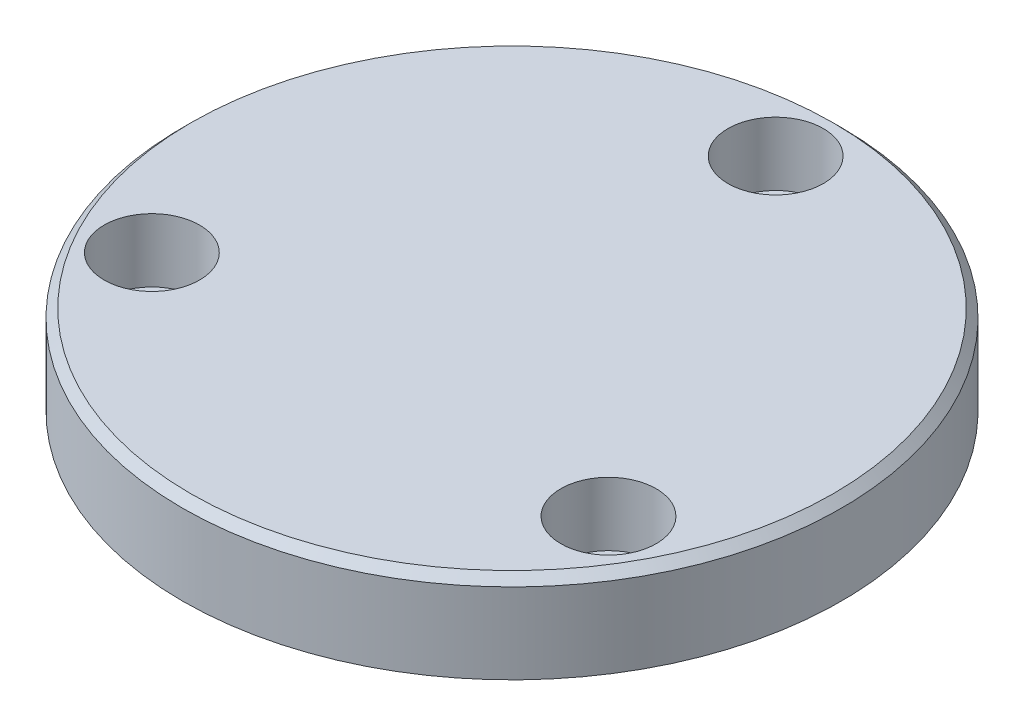
ISO-10303-21;
HEADER;
FILE_DESCRIPTION(('STEP AP214'),'2;1');
FILE_NAME('part.step','',(''),(''),'','','');
FILE_SCHEMA(('AUTOMOTIVE_DESIGN { 1 0 10303 214 1 1 1 1 }'));
ENDSEC;
DATA;
#1=APPLICATION_CONTEXT('core data for automotive mechanical design processes');
#2=APPLICATION_PROTOCOL_DEFINITION('international standard','automotive_design',2000,#1);
#3=PRODUCT_CONTEXT('',#1,'mechanical');
#4=PRODUCT('Part','Part','',(#3));
#5=PRODUCT_RELATED_PRODUCT_CATEGORY('part','',(#4));
#6=PRODUCT_DEFINITION_FORMATION('','',#4);
#7=PRODUCT_DEFINITION_CONTEXT('part definition',#1,'design');
#8=PRODUCT_DEFINITION('design','',#6,#7);
#9=PRODUCT_DEFINITION_SHAPE('','',#8);
#10=(LENGTH_UNIT() NAMED_UNIT(*) SI_UNIT(.MILLI.,.METRE.));
#11=(NAMED_UNIT(*) PLANE_ANGLE_UNIT() SI_UNIT($,.RADIAN.));
#12=(NAMED_UNIT(*) SI_UNIT($,.STERADIAN.) SOLID_ANGLE_UNIT());
#13=UNCERTAINTY_MEASURE_WITH_UNIT(LENGTH_MEASURE(1.E-05),#10,'distance_accuracy_value','');
#14=(GEOMETRIC_REPRESENTATION_CONTEXT(3) GLOBAL_UNCERTAINTY_ASSIGNED_CONTEXT((#13)) GLOBAL_UNIT_ASSIGNED_CONTEXT((#10,
#11,#12)) REPRESENTATION_CONTEXT('',''));
#15=CARTESIAN_POINT('',(0.,0.,0.));
#16=DIRECTION('',(0.,0.,1.));
#17=DIRECTION('',(1.,0.,0.));
#18=AXIS2_PLACEMENT_3D('',#15,#16,#17);
#19=CARTESIAN_POINT('',(0.,4.318,0.));
#20=DIRECTION('',(0.,-1.,0.));
#21=DIRECTION('',(0.,0.,-1.));
#22=AXIS2_PLACEMENT_3D('',#19,#20,#21);
#23=CYLINDRICAL_SURFACE('',#22,30.1625);
#24=CARTESIAN_POINT('',(0.,3.556,0.));
#25=DIRECTION('',(0.,1.,0.));
#26=DIRECTION('',(0.,0.,1.));
#27=AXIS2_PLACEMENT_3D('',#24,#25,#26);
#28=CIRCLE('',#27,30.1625);
#29=CARTESIAN_POINT('',(0.,3.556,30.1625));
#30=VERTEX_POINT('',#29);
#31=EDGE_CURVE('E10',#30,#30,#28,.F.);
#32=ORIENTED_EDGE('',*,*,#31,.T.);
#33=EDGE_LOOP('',(#32));
#34=FACE_BOUND('',#33,.T.);
#35=CARTESIAN_POINT('',(0.,-3.81,0.));
#36=DIRECTION('',(0.,-1.,0.));
#37=DIRECTION('',(0.,0.,-1.));
#38=AXIS2_PLACEMENT_3D('',#35,#36,#37);
#39=CIRCLE('',#38,30.1625);
#40=CARTESIAN_POINT('',(0.,-3.81,-30.1625));
#41=VERTEX_POINT('',#40);
#42=EDGE_CURVE('E87',#41,#41,#39,.T.);
#43=ORIENTED_EDGE('',*,*,#42,.F.);
#44=EDGE_LOOP('',(#43));
#45=FACE_BOUND('',#44,.T.);
#46=ADVANCED_FACE('F37',(#34,#45),#23,.T.);
#47=CARTESIAN_POINT('',(0.,-4.318,0.));
#48=DIRECTION('',(0.,1.,0.));
#49=DIRECTION('',(0.,0.,1.));
#50=AXIS2_PLACEMENT_3D('',#47,#48,#49);
#51=PLANE('',#50);
#52=CARTESIAN_POINT('',(-20.8971929933185,-4.318,12.0650000000001));
#53=DIRECTION('',(0.,1.,0.));
#54=DIRECTION('',(0.,0.,1.));
#55=AXIS2_PLACEMENT_3D('',#52,#53,#54);
#56=CIRCLE('',#55,2.45745);
#57=CARTESIAN_POINT('',(-20.8971929933185,-4.318,14.5224500000001));
#58=VERTEX_POINT('',#57);
#59=EDGE_CURVE('E72',#58,#58,#56,.T.);
#60=ORIENTED_EDGE('',*,*,#59,.T.);
#61=EDGE_LOOP('',(#60));
#62=FACE_BOUND('',#61,.T.);
#63=CARTESIAN_POINT('',(-20.8971929933185,-4.318,12.0650000000001));
#64=DIRECTION('',(0.,-1.,0.));
#65=DIRECTION('',(0.,0.,-1.));
#66=AXIS2_PLACEMENT_3D('',#63,#64,#65);
#67=CIRCLE('',#66,4.7625);
#68=CARTESIAN_POINT('',(-20.8971929933185,-4.318,7.3025000000001));
#69=VERTEX_POINT('',#68);
#70=EDGE_CURVE('E91',#69,#69,#67,.T.);
#71=ORIENTED_EDGE('',*,*,#70,.T.);
#72=EDGE_LOOP('',(#71));
#73=FACE_BOUND('',#72,.T.);
#74=ADVANCED_FACE('F125',(#62,#73),#51,.F.);
#75=CARTESIAN_POINT('',(0.,-4.318,-24.13));
#76=DIRECTION('',(0.,1.,0.));
#77=DIRECTION('',(0.,0.,1.));
#78=AXIS2_PLACEMENT_3D('',#75,#76,#77);
#79=CIRCLE('',#78,2.45745);
#80=CARTESIAN_POINT('',(0.,-4.318,-21.67255));
#81=VERTEX_POINT('',#80);
#82=EDGE_CURVE('E60',#81,#81,#79,.T.);
#83=ORIENTED_EDGE('',*,*,#82,.T.);
#84=EDGE_LOOP('',(#83));
#85=FACE_BOUND('',#84,.T.);
#86=CARTESIAN_POINT('',(0.,-4.318,-24.13));
#87=DIRECTION('',(0.,-1.,0.));
#88=DIRECTION('',(0.,0.,-1.));
#89=AXIS2_PLACEMENT_3D('',#86,#87,#88);
#90=CIRCLE('',#89,4.7625);
#91=CARTESIAN_POINT('',(0.,-4.318,-28.8925));
#92=VERTEX_POINT('',#91);
#93=EDGE_CURVE('E97',#92,#92,#90,.T.);
#94=ORIENTED_EDGE('',*,*,#93,.T.);
#95=EDGE_LOOP('',(#94));
#96=FACE_BOUND('',#95,.T.);
#97=ADVANCED_FACE('F129',(#85,#96),#51,.F.);
#98=CARTESIAN_POINT('',(20.8971929933186,-4.318,12.0649999999998));
#99=DIRECTION('',(0.,1.,0.));
#100=DIRECTION('',(0.,0.,1.));
#101=AXIS2_PLACEMENT_3D('',#98,#99,#100);
#102=CIRCLE('',#101,2.45745);
#103=CARTESIAN_POINT('',(20.8971929933186,-4.318,14.5224499999998));
#104=VERTEX_POINT('',#103);
#105=EDGE_CURVE('E84',#104,#104,#102,.T.);
#106=ORIENTED_EDGE('',*,*,#105,.T.);
#107=EDGE_LOOP('',(#106));
#108=FACE_BOUND('',#107,.T.);
#109=CARTESIAN_POINT('',(20.8971929933186,-4.318,12.0649999999998));
#110=DIRECTION('',(0.,-1.,0.));
#111=DIRECTION('',(0.,0.,-1.));
#112=AXIS2_PLACEMENT_3D('',#109,#110,#111);
#113=CIRCLE('',#112,4.7625);
#114=CARTESIAN_POINT('',(20.8971929933186,-4.318,7.30249999999981));
#115=VERTEX_POINT('',#114);
#116=EDGE_CURVE('E103',#115,#115,#113,.T.);
#117=ORIENTED_EDGE('',*,*,#116,.T.);
#118=EDGE_LOOP('',(#117));
#119=FACE_BOUND('',#118,.T.);
#120=ADVANCED_FACE('F132',(#108,#119),#51,.F.);
#121=CARTESIAN_POINT('',(0.,4.318,0.));
#122=DIRECTION('',(0.,1.,0.));
#123=DIRECTION('',(0.,0.,1.));
#124=AXIS2_PLACEMENT_3D('',#121,#122,#123);
#125=PLANE('',#124);
#126=CARTESIAN_POINT('',(0.,4.318,0.));
#127=DIRECTION('',(0.,1.,0.));
#128=DIRECTION('',(0.,0.,1.));
#129=AXIS2_PLACEMENT_3D('',#126,#127,#128);
#130=CIRCLE('',#129,29.4005);
#131=CARTESIAN_POINT('',(0.,4.318,29.4005));
#132=VERTEX_POINT('',#131);
#133=EDGE_CURVE('E44',#132,#132,#130,.T.);
#134=ORIENTED_EDGE('',*,*,#133,.T.);
#135=EDGE_LOOP('',(#134));
#136=FACE_BOUND('',#135,.T.);
#137=CARTESIAN_POINT('',(20.8971929933186,4.318,12.0649999999998));
#138=DIRECTION('',(0.,1.,0.));
#139=DIRECTION('',(0.,0.,1.));
#140=AXIS2_PLACEMENT_3D('',#137,#138,#139);
#141=CIRCLE('',#140,4.365625);
#142=CARTESIAN_POINT('',(20.8971929933186,4.318,16.4306249999998));
#143=VERTEX_POINT('',#142);
#144=EDGE_CURVE('E75',#143,#143,#141,.T.);
#145=ORIENTED_EDGE('',*,*,#144,.F.);
#146=EDGE_LOOP('',(#145));
#147=FACE_BOUND('',#146,.T.);
#148=CARTESIAN_POINT('',(-20.8971929933185,4.318,12.0650000000001));
#149=DIRECTION('',(0.,1.,0.));
#150=DIRECTION('',(0.,0.,1.));
#151=AXIS2_PLACEMENT_3D('',#148,#149,#150);
#152=CIRCLE('',#151,4.365625);
#153=CARTESIAN_POINT('',(-20.8971929933185,4.318,16.4306250000001));
#154=VERTEX_POINT('',#153);
#155=EDGE_CURVE('E63',#154,#154,#152,.T.);
#156=ORIENTED_EDGE('',*,*,#155,.F.);
#157=EDGE_LOOP('',(#156));
#158=FACE_BOUND('',#157,.T.);
#159=CARTESIAN_POINT('',(0.,4.318,-24.13));
#160=DIRECTION('',(0.,1.,0.));
#161=DIRECTION('',(0.,0.,1.));
#162=AXIS2_PLACEMENT_3D('',#159,#160,#161);
#163=CIRCLE('',#162,4.365625);
#164=CARTESIAN_POINT('',(0.,4.318,-19.764375));
#165=VERTEX_POINT('',#164);
#166=EDGE_CURVE('E48',#165,#165,#163,.T.);
#167=ORIENTED_EDGE('',*,*,#166,.F.);
#168=EDGE_LOOP('',(#167));
#169=FACE_BOUND('',#168,.T.);
#170=ADVANCED_FACE('F134',(#136,#147,#158,#169),#125,.T.);
#171=CARTESIAN_POINT('',(0.,4.318,-24.13));
#172=DIRECTION('',(0.,1.,0.));
#173=DIRECTION('',(0.,0.,1.));
#174=AXIS2_PLACEMENT_3D('',#171,#172,#173);
#175=CYLINDRICAL_SURFACE('',#174,4.365625);
#176=CARTESIAN_POINT('',(0.,-1.4986,-24.13));
#177=DIRECTION('',(0.,1.,0.));
#178=DIRECTION('',(0.,0.,1.));
#179=AXIS2_PLACEMENT_3D('',#176,#177,#178);
#180=CIRCLE('',#179,4.365625);
#181=CARTESIAN_POINT('',(0.,-1.4986,-19.764375));
#182=VERTEX_POINT('',#181);
#183=EDGE_CURVE('E52',#182,#182,#180,.T.);
#184=ORIENTED_EDGE('',*,*,#183,.F.);
#185=EDGE_LOOP('',(#184));
#186=FACE_BOUND('',#185,.T.);
#187=ORIENTED_EDGE('',*,*,#166,.T.);
#188=EDGE_LOOP('',(#187));
#189=FACE_BOUND('',#188,.T.);
#190=ADVANCED_FACE('F137',(#186,#189),#175,.F.);
#191=CARTESIAN_POINT('',(2.45745,-1.4986,-24.13));
#192=DIRECTION('',(0.,-1.,0.));
#193=DIRECTION('',(0.,0.,-1.));
#194=AXIS2_PLACEMENT_3D('',#191,#192,#193);
#195=PLANE('',#194);
#196=CARTESIAN_POINT('',(0.,-1.4986,-24.13));
#197=DIRECTION('',(0.,1.,0.));
#198=DIRECTION('',(0.,0.,1.));
#199=AXIS2_PLACEMENT_3D('',#196,#197,#198);
#200=CIRCLE('',#199,2.45745);
#201=CARTESIAN_POINT('',(0.,-1.4986,-21.67255));
#202=VERTEX_POINT('',#201);
#203=EDGE_CURVE('E57',#202,#202,#200,.T.);
#204=ORIENTED_EDGE('',*,*,#203,.F.);
#205=EDGE_LOOP('',(#204));
#206=FACE_BOUND('',#205,.T.);
#207=ORIENTED_EDGE('',*,*,#183,.T.);
#208=EDGE_LOOP('',(#207));
#209=FACE_BOUND('',#208,.T.);
#210=ADVANCED_FACE('F140',(#206,#209),#195,.F.);
#211=CARTESIAN_POINT('',(0.,4.318,-24.13));
#212=DIRECTION('',(0.,1.,0.));
#213=DIRECTION('',(0.,0.,1.));
#214=AXIS2_PLACEMENT_3D('',#211,#212,#213);
#215=CYLINDRICAL_SURFACE('',#214,2.45745);
#216=ORIENTED_EDGE('',*,*,#82,.F.);
#217=EDGE_LOOP('',(#216));
#218=FACE_BOUND('',#217,.T.);
#219=ORIENTED_EDGE('',*,*,#203,.T.);
#220=EDGE_LOOP('',(#219));
#221=FACE_BOUND('',#220,.T.);
#222=ADVANCED_FACE('F144',(#218,#221),#215,.F.);
#223=CARTESIAN_POINT('',(-20.8971929933185,4.318,12.0650000000001));
#224=DIRECTION('',(0.,1.,0.));
#225=DIRECTION('',(0.,0.,1.));
#226=AXIS2_PLACEMENT_3D('',#223,#224,#225);
#227=CYLINDRICAL_SURFACE('',#226,4.365625);
#228=CARTESIAN_POINT('',(-20.8971929933185,-1.4986,12.0650000000001));
#229=DIRECTION('',(0.,1.,0.));
#230=DIRECTION('',(0.,0.,1.));
#231=AXIS2_PLACEMENT_3D('',#228,#229,#230);
#232=CIRCLE('',#231,4.365625);
#233=CARTESIAN_POINT('',(-20.8971929933185,-1.4986,16.4306250000001));
#234=VERTEX_POINT('',#233);
#235=EDGE_CURVE('E66',#234,#234,#232,.T.);
#236=ORIENTED_EDGE('',*,*,#235,.F.);
#237=EDGE_LOOP('',(#236));
#238=FACE_BOUND('',#237,.T.);
#239=ORIENTED_EDGE('',*,*,#155,.T.);
#240=EDGE_LOOP('',(#239));
#241=FACE_BOUND('',#240,.T.);
#242=ADVANCED_FACE('F148',(#238,#241),#227,.F.);
#243=CARTESIAN_POINT('',(-18.4397429933185,-1.4986,12.0650000000001));
#244=DIRECTION('',(0.,-1.,0.));
#245=DIRECTION('',(0.,0.,-1.));
#246=AXIS2_PLACEMENT_3D('',#243,#244,#245);
#247=PLANE('',#246);
#248=CARTESIAN_POINT('',(-20.8971929933185,-1.4986,12.0650000000001));
#249=DIRECTION('',(0.,1.,0.));
#250=DIRECTION('',(0.,0.,1.));
#251=AXIS2_PLACEMENT_3D('',#248,#249,#250);
#252=CIRCLE('',#251,2.45745);
#253=CARTESIAN_POINT('',(-20.8971929933185,-1.4986,14.5224500000001));
#254=VERTEX_POINT('',#253);
#255=EDGE_CURVE('E69',#254,#254,#252,.T.);
#256=ORIENTED_EDGE('',*,*,#255,.F.);
#257=EDGE_LOOP('',(#256));
#258=FACE_BOUND('',#257,.T.);
#259=ORIENTED_EDGE('',*,*,#235,.T.);
#260=EDGE_LOOP('',(#259));
#261=FACE_BOUND('',#260,.T.);
#262=ADVANCED_FACE('F152',(#258,#261),#247,.F.);
#263=CARTESIAN_POINT('',(-20.8971929933185,4.318,12.0650000000001));
#264=DIRECTION('',(0.,1.,0.));
#265=DIRECTION('',(0.,0.,1.));
#266=AXIS2_PLACEMENT_3D('',#263,#264,#265);
#267=CYLINDRICAL_SURFACE('',#266,2.45745);
#268=ORIENTED_EDGE('',*,*,#59,.F.);
#269=EDGE_LOOP('',(#268));
#270=FACE_BOUND('',#269,.T.);
#271=ORIENTED_EDGE('',*,*,#255,.T.);
#272=EDGE_LOOP('',(#271));
#273=FACE_BOUND('',#272,.T.);
#274=ADVANCED_FACE('F156',(#270,#273),#267,.F.);
#275=CARTESIAN_POINT('',(20.8971929933186,4.318,12.0649999999998));
#276=DIRECTION('',(0.,1.,0.));
#277=DIRECTION('',(0.,0.,1.));
#278=AXIS2_PLACEMENT_3D('',#275,#276,#277);
#279=CYLINDRICAL_SURFACE('',#278,4.365625);
#280=CARTESIAN_POINT('',(20.8971929933186,-1.4986,12.0649999999998));
#281=DIRECTION('',(0.,1.,0.));
#282=DIRECTION('',(0.,0.,1.));
#283=AXIS2_PLACEMENT_3D('',#280,#281,#282);
#284=CIRCLE('',#283,4.365625);
#285=CARTESIAN_POINT('',(20.8971929933186,-1.4986,16.4306249999998));
#286=VERTEX_POINT('',#285);
#287=EDGE_CURVE('E78',#286,#286,#284,.T.);
#288=ORIENTED_EDGE('',*,*,#287,.F.);
#289=EDGE_LOOP('',(#288));
#290=FACE_BOUND('',#289,.T.);
#291=ORIENTED_EDGE('',*,*,#144,.T.);
#292=EDGE_LOOP('',(#291));
#293=FACE_BOUND('',#292,.T.);
#294=ADVANCED_FACE('F160',(#290,#293),#279,.F.);
#295=CARTESIAN_POINT('',(23.3546429933186,-1.4986,12.0649999999998));
#296=DIRECTION('',(0.,-1.,0.));
#297=DIRECTION('',(0.,0.,-1.));
#298=AXIS2_PLACEMENT_3D('',#295,#296,#297);
#299=PLANE('',#298);
#300=CARTESIAN_POINT('',(20.8971929933186,-1.4986,12.0649999999998));
#301=DIRECTION('',(0.,1.,0.));
#302=DIRECTION('',(0.,0.,1.));
#303=AXIS2_PLACEMENT_3D('',#300,#301,#302);
#304=CIRCLE('',#303,2.45745);
#305=CARTESIAN_POINT('',(20.8971929933186,-1.4986,14.5224499999998));
#306=VERTEX_POINT('',#305);
#307=EDGE_CURVE('E81',#306,#306,#304,.T.);
#308=ORIENTED_EDGE('',*,*,#307,.F.);
#309=EDGE_LOOP('',(#308));
#310=FACE_BOUND('',#309,.T.);
#311=ORIENTED_EDGE('',*,*,#287,.T.);
#312=EDGE_LOOP('',(#311));
#313=FACE_BOUND('',#312,.T.);
#314=ADVANCED_FACE('F164',(#310,#313),#299,.F.);
#315=CARTESIAN_POINT('',(20.8971929933186,4.318,12.0649999999998));
#316=DIRECTION('',(0.,1.,0.));
#317=DIRECTION('',(0.,0.,1.));
#318=AXIS2_PLACEMENT_3D('',#315,#316,#317);
#319=CYLINDRICAL_SURFACE('',#318,2.45745);
#320=ORIENTED_EDGE('',*,*,#105,.F.);
#321=EDGE_LOOP('',(#320));
#322=FACE_BOUND('',#321,.T.);
#323=ORIENTED_EDGE('',*,*,#307,.T.);
#324=EDGE_LOOP('',(#323));
#325=FACE_BOUND('',#324,.T.);
#326=ADVANCED_FACE('F116',(#322,#325),#319,.F.);
#327=CARTESIAN_POINT('',(0.,-3.81,0.));
#328=DIRECTION('',(0.,-1.,0.));
#329=DIRECTION('',(0.,0.,-1.));
#330=AXIS2_PLACEMENT_3D('',#327,#328,#329);
#331=PLANE('',#330);
#332=CARTESIAN_POINT('',(20.8971929933186,-3.81,12.0649999999998));
#333=DIRECTION('',(0.,-1.,0.));
#334=DIRECTION('',(0.,0.,-1.));
#335=AXIS2_PLACEMENT_3D('',#332,#333,#334);
#336=CIRCLE('',#335,4.7625);
#337=CARTESIAN_POINT('',(20.8971929933186,-3.81,7.30249999999981));
#338=VERTEX_POINT('',#337);
#339=EDGE_CURVE('E100',#338,#338,#336,.T.);
#340=ORIENTED_EDGE('',*,*,#339,.F.);
#341=EDGE_LOOP('',(#340));
#342=FACE_BOUND('',#341,.T.);
#343=CARTESIAN_POINT('',(0.,-3.81,-24.13));
#344=DIRECTION('',(0.,-1.,0.));
#345=DIRECTION('',(0.,0.,-1.));
#346=AXIS2_PLACEMENT_3D('',#343,#344,#345);
#347=CIRCLE('',#346,4.7625);
#348=CARTESIAN_POINT('',(0.,-3.81,-28.8925));
#349=VERTEX_POINT('',#348);
#350=EDGE_CURVE('E94',#349,#349,#347,.T.);
#351=ORIENTED_EDGE('',*,*,#350,.F.);
#352=EDGE_LOOP('',(#351));
#353=FACE_BOUND('',#352,.T.);
#354=CARTESIAN_POINT('',(-20.8971929933185,-3.81,12.0650000000001));
#355=DIRECTION('',(0.,-1.,0.));
#356=DIRECTION('',(0.,0.,-1.));
#357=AXIS2_PLACEMENT_3D('',#354,#355,#356);
#358=CIRCLE('',#357,4.7625);
#359=CARTESIAN_POINT('',(-20.8971929933185,-3.81,7.3025000000001));
#360=VERTEX_POINT('',#359);
#361=EDGE_CURVE('E90',#360,#360,#358,.T.);
#362=ORIENTED_EDGE('',*,*,#361,.F.);
#363=EDGE_LOOP('',(#362));
#364=FACE_BOUND('',#363,.T.);
#365=ORIENTED_EDGE('',*,*,#42,.T.);
#366=EDGE_LOOP('',(#365));
#367=FACE_BOUND('',#366,.T.);
#368=ADVANCED_FACE('F112',(#342,#353,#364,#367),#331,.T.);
#369=CARTESIAN_POINT('',(-20.8971929933185,-3.81,12.0650000000001));
#370=DIRECTION('',(0.,-1.,0.));
#371=DIRECTION('',(0.,0.,-1.));
#372=AXIS2_PLACEMENT_3D('',#369,#370,#371);
#373=CYLINDRICAL_SURFACE('',#372,4.7625);
#374=ORIENTED_EDGE('',*,*,#361,.T.);
#375=EDGE_LOOP('',(#374));
#376=FACE_BOUND('',#375,.T.);
#377=ORIENTED_EDGE('',*,*,#70,.F.);
#378=EDGE_LOOP('',(#377));
#379=FACE_BOUND('',#378,.T.);
#380=ADVANCED_FACE('F115',(#376,#379),#373,.T.);
#381=CARTESIAN_POINT('',(0.,-3.81,-24.13));
#382=DIRECTION('',(0.,-1.,0.));
#383=DIRECTION('',(0.,0.,-1.));
#384=AXIS2_PLACEMENT_3D('',#381,#382,#383);
#385=CYLINDRICAL_SURFACE('',#384,4.7625);
#386=ORIENTED_EDGE('',*,*,#350,.T.);
#387=EDGE_LOOP('',(#386));
#388=FACE_BOUND('',#387,.T.);
#389=ORIENTED_EDGE('',*,*,#93,.F.);
#390=EDGE_LOOP('',(#389));
#391=FACE_BOUND('',#390,.T.);
#392=ADVANCED_FACE('F174',(#388,#391),#385,.T.);
#393=CARTESIAN_POINT('',(20.8971929933186,-3.81,12.0649999999998));
#394=DIRECTION('',(0.,-1.,0.));
#395=DIRECTION('',(0.,0.,-1.));
#396=AXIS2_PLACEMENT_3D('',#393,#394,#395);
#397=CYLINDRICAL_SURFACE('',#396,4.7625);
#398=ORIENTED_EDGE('',*,*,#339,.T.);
#399=EDGE_LOOP('',(#398));
#400=FACE_BOUND('',#399,.T.);
#401=ORIENTED_EDGE('',*,*,#116,.F.);
#402=EDGE_LOOP('',(#401));
#403=FACE_BOUND('',#402,.T.);
#404=ADVANCED_FACE('F109',(#400,#403),#397,.T.);
#405=CARTESIAN_POINT('',(0.,4.318,0.));
#406=DIRECTION('',(0.,-1.,0.));
#407=DIRECTION('',(0.,0.,-1.));
#408=AXIS2_PLACEMENT_3D('',#405,#406,#407);
#409=CONICAL_SURFACE('',#408,29.4005,0.785398163397446);
#410=ORIENTED_EDGE('',*,*,#31,.F.);
#411=EDGE_LOOP('',(#410));
#412=FACE_BOUND('',#411,.T.);
#413=ORIENTED_EDGE('',*,*,#133,.F.);
#414=EDGE_LOOP('',(#413));
#415=FACE_BOUND('',#414,.T.);
#416=ADVANCED_FACE('F39',(#412,#415),#409,.T.);
#417=CLOSED_SHELL('',(#46,#74,#97,#120,#170,#190,#210,#222,#242,#262,#274,#294,#314,#326,#368,
#380,#392,#404,#416));
#418=MANIFOLD_SOLID_BREP('B2',#417);
#419=ADVANCED_BREP_SHAPE_REPRESENTATION('',(#18,#418),#14);
#420=SHAPE_DEFINITION_REPRESENTATION(#9,#419);
ENDSEC;
END-ISO-10303-21;
